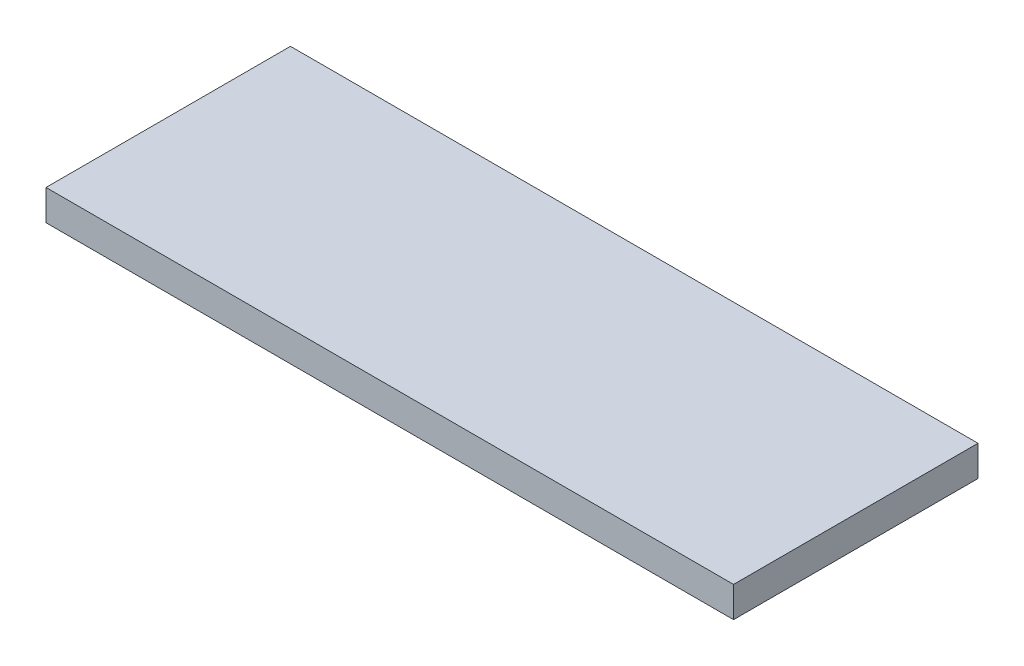
ISO-10303-21;
HEADER;
FILE_DESCRIPTION(('STEP AP214'),'2;1');
FILE_NAME('part.step','',(''),(''),'','','');
FILE_SCHEMA(('AUTOMOTIVE_DESIGN { 1 0 10303 214 1 1 1 1 }'));
ENDSEC;
DATA;
#1=APPLICATION_CONTEXT('core data for automotive mechanical design processes');
#2=APPLICATION_PROTOCOL_DEFINITION('international standard','automotive_design',2000,#1);
#3=PRODUCT_CONTEXT('',#1,'mechanical');
#4=PRODUCT('Part','Part','',(#3));
#5=PRODUCT_RELATED_PRODUCT_CATEGORY('part','',(#4));
#6=PRODUCT_DEFINITION_FORMATION('','',#4);
#7=PRODUCT_DEFINITION_CONTEXT('part definition',#1,'design');
#8=PRODUCT_DEFINITION('design','',#6,#7);
#9=PRODUCT_DEFINITION_SHAPE('','',#8);
#10=(LENGTH_UNIT() NAMED_UNIT(*) SI_UNIT(.MILLI.,.METRE.));
#11=(NAMED_UNIT(*) PLANE_ANGLE_UNIT() SI_UNIT($,.RADIAN.));
#12=(NAMED_UNIT(*) SI_UNIT($,.STERADIAN.) SOLID_ANGLE_UNIT());
#13=UNCERTAINTY_MEASURE_WITH_UNIT(LENGTH_MEASURE(1.E-05),#10,'distance_accuracy_value','');
#14=(GEOMETRIC_REPRESENTATION_CONTEXT(3) GLOBAL_UNCERTAINTY_ASSIGNED_CONTEXT((#13)) GLOBAL_UNIT_ASSIGNED_CONTEXT((#10,
#11,#12)) REPRESENTATION_CONTEXT('',''));
#15=CARTESIAN_POINT('',(0.,0.,0.));
#16=DIRECTION('',(0.,0.,1.));
#17=DIRECTION('',(1.,0.,0.));
#18=AXIS2_PLACEMENT_3D('',#15,#16,#17);
#19=CARTESIAN_POINT('',(225.,20.,80.));
#20=DIRECTION('',(-1.,0.,0.));
#21=DIRECTION('',(0.,0.,1.));
#22=AXIS2_PLACEMENT_3D('',#19,#20,#21);
#23=PLANE('',#22);
#24=DIRECTION('',(0.,0.,-1.));
#25=VECTOR('',#24,1.);
#26=CARTESIAN_POINT('',(225.,0.,80.));
#27=LINE('',#26,#25);
#28=CARTESIAN_POINT('',(225.,0.,80.));
#29=VERTEX_POINT('',#28);
#30=CARTESIAN_POINT('',(225.,0.,-80.));
#31=VERTEX_POINT('',#30);
#32=EDGE_CURVE('E102',#29,#31,#27,.T.);
#33=ORIENTED_EDGE('',*,*,#32,.T.);
#34=DIRECTION('',(0.,-1.,0.));
#35=VECTOR('',#34,1.);
#36=CARTESIAN_POINT('',(225.,20.,-80.));
#37=LINE('',#36,#35);
#38=CARTESIAN_POINT('',(225.,20.,-80.));
#39=VERTEX_POINT('',#38);
#40=EDGE_CURVE('E11',#39,#31,#37,.T.);
#41=ORIENTED_EDGE('',*,*,#40,.F.);
#42=DIRECTION('',(0.,0.,-1.));
#43=VECTOR('',#42,1.);
#44=CARTESIAN_POINT('',(225.,20.,80.));
#45=LINE('',#44,#43);
#46=CARTESIAN_POINT('',(225.,20.,80.));
#47=VERTEX_POINT('',#46);
#48=EDGE_CURVE('E90',#47,#39,#45,.T.);
#49=ORIENTED_EDGE('',*,*,#48,.F.);
#50=DIRECTION('',(0.,-1.,0.));
#51=VECTOR('',#50,1.);
#52=CARTESIAN_POINT('',(225.,20.,80.));
#53=LINE('',#52,#51);
#54=EDGE_CURVE('E98',#47,#29,#53,.T.);
#55=ORIENTED_EDGE('',*,*,#54,.T.);
#56=EDGE_LOOP('',(#33,#41,#49,#55));
#57=FACE_BOUND('',#56,.T.);
#58=ADVANCED_FACE('F39',(#57),#23,.F.);
#59=CARTESIAN_POINT('',(-225.,20.,-80.));
#60=DIRECTION('',(0.,0.,1.));
#61=DIRECTION('',(1.,0.,0.));
#62=AXIS2_PLACEMENT_3D('',#59,#60,#61);
#63=PLANE('',#62);
#64=DIRECTION('',(-1.,0.,0.));
#65=VECTOR('',#64,1.);
#66=CARTESIAN_POINT('',(-225.,0.,-80.));
#67=LINE('',#66,#65);
#68=CARTESIAN_POINT('',(-225.,0.,-80.));
#69=VERTEX_POINT('',#68);
#70=EDGE_CURVE('E94',#31,#69,#67,.T.);
#71=ORIENTED_EDGE('',*,*,#70,.T.);
#72=DIRECTION('',(0.,-1.,0.));
#73=VECTOR('',#72,1.);
#74=CARTESIAN_POINT('',(-225.,20.,-80.));
#75=LINE('',#74,#73);
#76=CARTESIAN_POINT('',(-225.,20.,-80.));
#77=VERTEX_POINT('',#76);
#78=EDGE_CURVE('E47',#77,#69,#75,.T.);
#79=ORIENTED_EDGE('',*,*,#78,.F.);
#80=DIRECTION('',(-1.,0.,0.));
#81=VECTOR('',#80,1.);
#82=CARTESIAN_POINT('',(-225.,20.,-80.));
#83=LINE('',#82,#81);
#84=EDGE_CURVE('E85',#39,#77,#83,.T.);
#85=ORIENTED_EDGE('',*,*,#84,.F.);
#86=ORIENTED_EDGE('',*,*,#40,.T.);
#87=EDGE_LOOP('',(#71,#79,#85,#86));
#88=FACE_BOUND('',#87,.T.);
#89=ADVANCED_FACE('F93',(#88),#63,.F.);
#90=CARTESIAN_POINT('',(-225.,20.,80.));
#91=DIRECTION('',(1.,0.,0.));
#92=DIRECTION('',(0.,0.,-1.));
#93=AXIS2_PLACEMENT_3D('',#90,#91,#92);
#94=PLANE('',#93);
#95=DIRECTION('',(0.,0.,1.));
#96=VECTOR('',#95,1.);
#97=CARTESIAN_POINT('',(-225.,0.,80.));
#98=LINE('',#97,#96);
#99=CARTESIAN_POINT('',(-225.,0.,80.));
#100=VERTEX_POINT('',#99);
#101=EDGE_CURVE('E72',#69,#100,#98,.T.);
#102=ORIENTED_EDGE('',*,*,#101,.T.);
#103=DIRECTION('',(0.,-1.,0.));
#104=VECTOR('',#103,1.);
#105=CARTESIAN_POINT('',(-225.,20.,80.));
#106=LINE('',#105,#104);
#107=CARTESIAN_POINT('',(-225.,20.,80.));
#108=VERTEX_POINT('',#107);
#109=EDGE_CURVE('E95',#108,#100,#106,.T.);
#110=ORIENTED_EDGE('',*,*,#109,.F.);
#111=DIRECTION('',(0.,0.,1.));
#112=VECTOR('',#111,1.);
#113=CARTESIAN_POINT('',(-225.,20.,80.));
#114=LINE('',#113,#112);
#115=EDGE_CURVE('E88',#77,#108,#114,.T.);
#116=ORIENTED_EDGE('',*,*,#115,.F.);
#117=ORIENTED_EDGE('',*,*,#78,.T.);
#118=EDGE_LOOP('',(#102,#110,#116,#117));
#119=FACE_BOUND('',#118,.T.);
#120=ADVANCED_FACE('F96',(#119),#94,.F.);
#121=CARTESIAN_POINT('',(-225.,20.,80.));
#122=DIRECTION('',(0.,0.,-1.));
#123=DIRECTION('',(-1.,0.,0.));
#124=AXIS2_PLACEMENT_3D('',#121,#122,#123);
#125=PLANE('',#124);
#126=DIRECTION('',(1.,0.,0.));
#127=VECTOR('',#126,1.);
#128=CARTESIAN_POINT('',(-225.,0.,80.));
#129=LINE('',#128,#127);
#130=EDGE_CURVE('E78',#100,#29,#129,.T.);
#131=ORIENTED_EDGE('',*,*,#130,.T.);
#132=ORIENTED_EDGE('',*,*,#54,.F.);
#133=DIRECTION('',(1.,0.,0.));
#134=VECTOR('',#133,1.);
#135=CARTESIAN_POINT('',(-225.,20.,80.));
#136=LINE('',#135,#134);
#137=EDGE_CURVE('E55',#108,#47,#136,.T.);
#138=ORIENTED_EDGE('',*,*,#137,.F.);
#139=ORIENTED_EDGE('',*,*,#109,.T.);
#140=EDGE_LOOP('',(#131,#132,#138,#139));
#141=FACE_BOUND('',#140,.T.);
#142=ADVANCED_FACE('F109',(#141),#125,.F.);
#143=CARTESIAN_POINT('',(0.,20.,0.));
#144=DIRECTION('',(0.,-1.,0.));
#145=DIRECTION('',(0.,0.,-1.));
#146=AXIS2_PLACEMENT_3D('',#143,#144,#145);
#147=PLANE('',#146);
#148=ORIENTED_EDGE('',*,*,#48,.T.);
#149=ORIENTED_EDGE('',*,*,#84,.T.);
#150=ORIENTED_EDGE('',*,*,#115,.T.);
#151=ORIENTED_EDGE('',*,*,#137,.T.);
#152=EDGE_LOOP('',(#148,#149,#150,#151));
#153=FACE_BOUND('',#152,.T.);
#154=ADVANCED_FACE('F86',(#153),#147,.F.);
#155=CARTESIAN_POINT('',(0.,0.,0.));
#156=DIRECTION('',(0.,-1.,0.));
#157=DIRECTION('',(0.,0.,-1.));
#158=AXIS2_PLACEMENT_3D('',#155,#156,#157);
#159=PLANE('',#158);
#160=ORIENTED_EDGE('',*,*,#32,.F.);
#161=ORIENTED_EDGE('',*,*,#130,.F.);
#162=ORIENTED_EDGE('',*,*,#101,.F.);
#163=ORIENTED_EDGE('',*,*,#70,.F.);
#164=EDGE_LOOP('',(#160,#161,#162,#163));
#165=FACE_BOUND('',#164,.T.);
#166=ADVANCED_FACE('F112',(#165),#159,.T.);
#167=CLOSED_SHELL('',(#58,#89,#120,#142,#154,#166));
#168=MANIFOLD_SOLID_BREP('B2',#167);
#169=ADVANCED_BREP_SHAPE_REPRESENTATION('',(#18,#168),#14);
#170=SHAPE_DEFINITION_REPRESENTATION(#9,#169);
ENDSEC;
END-ISO-10303-21;
